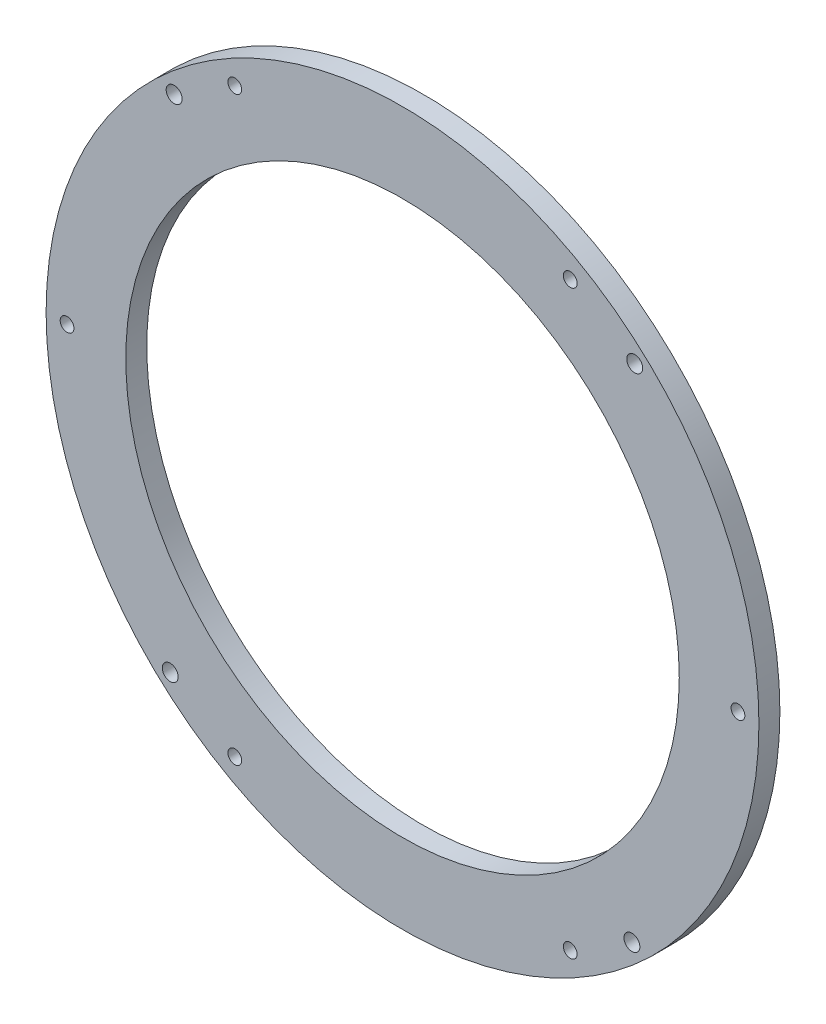
ISO-10303-21;
HEADER;
FILE_DESCRIPTION(('STEP AP214'),'2;1');
FILE_NAME('part.step','',(''),(''),'','','');
FILE_SCHEMA(('AUTOMOTIVE_DESIGN { 1 0 10303 214 1 1 1 1 }'));
ENDSEC;
DATA;
#1=APPLICATION_CONTEXT('core data for automotive mechanical design processes');
#2=APPLICATION_PROTOCOL_DEFINITION('international standard','automotive_design',2000,#1);
#3=PRODUCT_CONTEXT('',#1,'mechanical');
#4=PRODUCT('Part','Part','',(#3));
#5=PRODUCT_RELATED_PRODUCT_CATEGORY('part','',(#4));
#6=PRODUCT_DEFINITION_FORMATION('','',#4);
#7=PRODUCT_DEFINITION_CONTEXT('part definition',#1,'design');
#8=PRODUCT_DEFINITION('design','',#6,#7);
#9=PRODUCT_DEFINITION_SHAPE('','',#8);
#10=(LENGTH_UNIT() NAMED_UNIT(*) SI_UNIT(.MILLI.,.METRE.));
#11=(NAMED_UNIT(*) PLANE_ANGLE_UNIT() SI_UNIT($,.RADIAN.));
#12=(NAMED_UNIT(*) SI_UNIT($,.STERADIAN.) SOLID_ANGLE_UNIT());
#13=UNCERTAINTY_MEASURE_WITH_UNIT(LENGTH_MEASURE(1.E-05),#10,'distance_accuracy_value','');
#14=(GEOMETRIC_REPRESENTATION_CONTEXT(3) GLOBAL_UNCERTAINTY_ASSIGNED_CONTEXT((#13)) GLOBAL_UNIT_ASSIGNED_CONTEXT((#10,
#11,#12)) REPRESENTATION_CONTEXT('',''));
#15=CARTESIAN_POINT('',(0.,0.,0.));
#16=DIRECTION('',(0.,0.,1.));
#17=DIRECTION('',(1.,0.,0.));
#18=AXIS2_PLACEMENT_3D('',#15,#16,#17);
#19=CARTESIAN_POINT('',(51.7383814674162,55.5933193944043,6.35));
#20=DIRECTION('',(0.,0.,1.));
#21=DIRECTION('',(1.,0.,0.));
#22=AXIS2_PLACEMENT_3D('',#19,#20,#21);
#23=PLANE('',#22);
#24=CARTESIAN_POINT('',(122.063410719543,131.252946957816,6.35));
#25=DIRECTION('',(0.,0.,1.));
#26=DIRECTION('',(1.,0.,0.));
#27=AXIS2_PLACEMENT_3D('',#24,#25,#26);
#28=CIRCLE('',#27,2.41300000000001);
#29=CARTESIAN_POINT('',(124.476410719543,131.252946957816,6.35));
#30=VERTEX_POINT('',#29);
#31=EDGE_CURVE('E145',#30,#30,#28,.T.);
#32=ORIENTED_EDGE('',*,*,#31,.F.);
#33=EDGE_LOOP('',(#32));
#34=FACE_BOUND('',#33,.T.);
#35=CARTESIAN_POINT('',(-17.430655728391,132.126237321712,6.35));
#36=DIRECTION('',(0.,0.,1.));
#37=DIRECTION('',(1.,0.,0.));
#38=AXIS2_PLACEMENT_3D('',#35,#36,#37);
#39=CIRCLE('',#38,2.41300000000001);
#40=CARTESIAN_POINT('',(-15.017655728391,132.126237321712,6.35));
#41=VERTEX_POINT('',#40);
#42=EDGE_CURVE('E138',#41,#41,#39,.T.);
#43=ORIENTED_EDGE('',*,*,#42,.F.);
#44=EDGE_LOOP('',(#43));
#45=FACE_BOUND('',#44,.T.);
#46=CARTESIAN_POINT('',(102.538381467416,-32.3948616300948,6.35));
#47=DIRECTION('',(0.,0.,1.));
#48=DIRECTION('',(1.,0.,0.));
#49=AXIS2_PLACEMENT_3D('',#46,#47,#48);
#50=CIRCLE('',#49,2.085);
#51=CARTESIAN_POINT('',(104.623381467416,-32.3948616300948,6.35));
#52=VERTEX_POINT('',#51);
#53=EDGE_CURVE('E71',#52,#52,#50,.T.);
#54=ORIENTED_EDGE('',*,*,#53,.F.);
#55=EDGE_LOOP('',(#54));
#56=FACE_BOUND('',#55,.T.);
#57=CARTESIAN_POINT('',(153.338381467416,55.5933193944041,6.35));
#58=DIRECTION('',(0.,0.,1.));
#59=DIRECTION('',(1.,0.,0.));
#60=AXIS2_PLACEMENT_3D('',#57,#58,#59);
#61=CIRCLE('',#60,2.08500000000002);
#62=CARTESIAN_POINT('',(155.423381467416,55.5933193944041,6.35));
#63=VERTEX_POINT('',#62);
#64=EDGE_CURVE('E78',#63,#63,#61,.T.);
#65=ORIENTED_EDGE('',*,*,#64,.F.);
#66=EDGE_LOOP('',(#65));
#67=FACE_BOUND('',#66,.T.);
#68=CARTESIAN_POINT('',(102.538381467416,143.581500418903,6.35));
#69=DIRECTION('',(0.,0.,1.));
#70=DIRECTION('',(1.,0.,0.));
#71=AXIS2_PLACEMENT_3D('',#68,#69,#70);
#72=CIRCLE('',#71,2.085);
#73=CARTESIAN_POINT('',(104.623381467416,143.581500418903,6.35));
#74=VERTEX_POINT('',#73);
#75=EDGE_CURVE('E82',#74,#74,#72,.T.);
#76=ORIENTED_EDGE('',*,*,#75,.F.);
#77=EDGE_LOOP('',(#76));
#78=FACE_BOUND('',#77,.T.);
#79=CARTESIAN_POINT('',(0.938381467416333,143.581500418903,6.35));
#80=DIRECTION('',(0.,0.,1.));
#81=DIRECTION('',(1.,0.,0.));
#82=AXIS2_PLACEMENT_3D('',#79,#80,#81);
#83=CIRCLE('',#82,2.08500000000001);
#84=CARTESIAN_POINT('',(3.02338146741635,143.581500418903,6.35));
#85=VERTEX_POINT('',#84);
#86=EDGE_CURVE('E86',#85,#85,#83,.T.);
#87=ORIENTED_EDGE('',*,*,#86,.F.);
#88=EDGE_LOOP('',(#87));
#89=FACE_BOUND('',#88,.T.);
#90=CARTESIAN_POINT('',(-18.6153813848059,-20.0661282846542,6.35));
#91=DIRECTION('',(0.,0.,1.));
#92=DIRECTION('',(1.,0.,0.));
#93=AXIS2_PLACEMENT_3D('',#90,#91,#92);
#94=CIRCLE('',#93,2.413);
#95=CARTESIAN_POINT('',(-16.2023813848059,-20.0661282846542,6.35));
#96=VERTEX_POINT('',#95);
#97=EDGE_CURVE('E90',#96,#96,#94,.T.);
#98=ORIENTED_EDGE('',*,*,#97,.F.);
#99=EDGE_LOOP('',(#98));
#100=FACE_BOUND('',#99,.T.);
#101=CARTESIAN_POINT('',(121.212212688711,-20.941506668987,6.35));
#102=DIRECTION('',(0.,0.,1.));
#103=DIRECTION('',(1.,0.,0.));
#104=AXIS2_PLACEMENT_3D('',#101,#102,#103);
#105=CIRCLE('',#104,2.41300000000001);
#106=CARTESIAN_POINT('',(123.625212688711,-20.941506668987,6.35));
#107=VERTEX_POINT('',#106);
#108=EDGE_CURVE('E94',#107,#107,#105,.T.);
#109=ORIENTED_EDGE('',*,*,#108,.F.);
#110=EDGE_LOOP('',(#109));
#111=FACE_BOUND('',#110,.T.);
#112=CARTESIAN_POINT('',(-49.8616185325838,55.5933193944045,6.35));
#113=DIRECTION('',(0.,0.,1.));
#114=DIRECTION('',(1.,0.,0.));
#115=AXIS2_PLACEMENT_3D('',#112,#113,#114);
#116=CIRCLE('',#115,2.085);
#117=CARTESIAN_POINT('',(-47.7766185325838,55.5933193944045,6.35));
#118=VERTEX_POINT('',#117);
#119=EDGE_CURVE('E98',#118,#118,#116,.T.);
#120=ORIENTED_EDGE('',*,*,#119,.F.);
#121=EDGE_LOOP('',(#120));
#122=FACE_BOUND('',#121,.T.);
#123=CARTESIAN_POINT('',(0.938381467416061,-32.3948616300946,6.35));
#124=DIRECTION('',(0.,0.,1.));
#125=DIRECTION('',(1.,0.,0.));
#126=AXIS2_PLACEMENT_3D('',#123,#124,#125);
#127=CIRCLE('',#126,2.08500000000002);
#128=CARTESIAN_POINT('',(3.02338146741608,-32.3948616300946,6.35));
#129=VERTEX_POINT('',#128);
#130=EDGE_CURVE('E102',#129,#129,#127,.T.);
#131=ORIENTED_EDGE('',*,*,#130,.F.);
#132=EDGE_LOOP('',(#131));
#133=FACE_BOUND('',#132,.T.);
#134=CARTESIAN_POINT('',(51.7383814674162,55.5933193944043,6.35));
#135=DIRECTION('',(0.,0.,1.));
#136=DIRECTION('',(1.,0.,0.));
#137=AXIS2_PLACEMENT_3D('',#134,#135,#136);
#138=CIRCLE('',#137,107.95);
#139=CARTESIAN_POINT('',(159.688381467416,55.5933193944043,6.35));
#140=VERTEX_POINT('',#139);
#141=EDGE_CURVE('E12',#140,#140,#138,.T.);
#142=ORIENTED_EDGE('',*,*,#141,.T.);
#143=EDGE_LOOP('',(#142));
#144=FACE_BOUND('',#143,.T.);
#145=CARTESIAN_POINT('',(51.7383814674162,55.5933193944043,6.35));
#146=DIRECTION('',(0.,0.,1.));
#147=DIRECTION('',(1.,0.,0.));
#148=AXIS2_PLACEMENT_3D('',#145,#146,#147);
#149=CIRCLE('',#148,83.82);
#150=CARTESIAN_POINT('',(135.558381467416,55.5933193944043,6.35));
#151=VERTEX_POINT('',#150);
#152=EDGE_CURVE('E65',#151,#151,#149,.T.);
#153=ORIENTED_EDGE('',*,*,#152,.F.);
#154=EDGE_LOOP('',(#153));
#155=FACE_BOUND('',#154,.T.);
#156=ADVANCED_FACE('F50',(#34,#45,#56,#67,#78,#89,#100,#111,#122,#133,#144,#155),#23,.T.);
#157=CARTESIAN_POINT('',(51.7383814674162,55.5933193944043,0.));
#158=DIRECTION('',(0.,0.,1.));
#159=DIRECTION('',(1.,0.,0.));
#160=AXIS2_PLACEMENT_3D('',#157,#158,#159);
#161=PLANE('',#160);
#162=CARTESIAN_POINT('',(122.063410719543,131.252946957816,0.));
#163=DIRECTION('',(0.,0.,1.));
#164=DIRECTION('',(1.,0.,0.));
#165=AXIS2_PLACEMENT_3D('',#162,#163,#164);
#166=CIRCLE('',#165,2.41300000000001);
#167=CARTESIAN_POINT('',(124.476410719543,131.252946957816,0.));
#168=VERTEX_POINT('',#167);
#169=EDGE_CURVE('E137',#168,#168,#166,.T.);
#170=ORIENTED_EDGE('',*,*,#169,.T.);
#171=EDGE_LOOP('',(#170));
#172=FACE_BOUND('',#171,.T.);
#173=CARTESIAN_POINT('',(-17.430655728391,132.126237321712,0.));
#174=DIRECTION('',(0.,0.,1.));
#175=DIRECTION('',(1.,0.,0.));
#176=AXIS2_PLACEMENT_3D('',#173,#174,#175);
#177=CIRCLE('',#176,2.41300000000001);
#178=CARTESIAN_POINT('',(-15.017655728391,132.126237321712,0.));
#179=VERTEX_POINT('',#178);
#180=EDGE_CURVE('E141',#179,#179,#177,.T.);
#181=ORIENTED_EDGE('',*,*,#180,.T.);
#182=EDGE_LOOP('',(#181));
#183=FACE_BOUND('',#182,.T.);
#184=CARTESIAN_POINT('',(102.538381467416,-32.3948616300948,0.));
#185=DIRECTION('',(0.,0.,-1.));
#186=DIRECTION('',(-1.,0.,0.));
#187=AXIS2_PLACEMENT_3D('',#184,#185,#186);
#188=CIRCLE('',#187,2.085);
#189=CARTESIAN_POINT('',(100.453381467416,-32.3948616300948,0.));
#190=VERTEX_POINT('',#189);
#191=EDGE_CURVE('E110',#190,#190,#188,.T.);
#192=ORIENTED_EDGE('',*,*,#191,.F.);
#193=EDGE_LOOP('',(#192));
#194=FACE_BOUND('',#193,.T.);
#195=CARTESIAN_POINT('',(153.338381467416,55.5933193944041,0.));
#196=DIRECTION('',(0.,0.,-1.));
#197=DIRECTION('',(-1.,0.,0.));
#198=AXIS2_PLACEMENT_3D('',#195,#196,#197);
#199=CIRCLE('',#198,2.08500000000002);
#200=CARTESIAN_POINT('',(151.253381467416,55.5933193944041,0.));
#201=VERTEX_POINT('',#200);
#202=EDGE_CURVE('E120',#201,#201,#199,.T.);
#203=ORIENTED_EDGE('',*,*,#202,.F.);
#204=EDGE_LOOP('',(#203));
#205=FACE_BOUND('',#204,.T.);
#206=CARTESIAN_POINT('',(102.538381467416,143.581500418903,0.));
#207=DIRECTION('',(0.,0.,-1.));
#208=DIRECTION('',(-1.,0.,0.));
#209=AXIS2_PLACEMENT_3D('',#206,#207,#208);
#210=CIRCLE('',#209,2.085);
#211=CARTESIAN_POINT('',(100.453381467416,143.581500418903,0.));
#212=VERTEX_POINT('',#211);
#213=EDGE_CURVE('E115',#212,#212,#210,.T.);
#214=ORIENTED_EDGE('',*,*,#213,.F.);
#215=EDGE_LOOP('',(#214));
#216=FACE_BOUND('',#215,.T.);
#217=CARTESIAN_POINT('',(0.938381467416333,143.581500418903,0.));
#218=DIRECTION('',(0.,0.,-1.));
#219=DIRECTION('',(-1.,0.,0.));
#220=AXIS2_PLACEMENT_3D('',#217,#218,#219);
#221=CIRCLE('',#220,2.08500000000001);
#222=CARTESIAN_POINT('',(-1.14661853258368,143.581500418903,0.));
#223=VERTEX_POINT('',#222);
#224=EDGE_CURVE('E111',#223,#223,#221,.T.);
#225=ORIENTED_EDGE('',*,*,#224,.F.);
#226=EDGE_LOOP('',(#225));
#227=FACE_BOUND('',#226,.T.);
#228=CARTESIAN_POINT('',(-18.6153813848059,-20.0661282846542,0.));
#229=DIRECTION('',(0.,0.,-1.));
#230=DIRECTION('',(-1.,0.,0.));
#231=AXIS2_PLACEMENT_3D('',#228,#229,#230);
#232=CIRCLE('',#231,2.413);
#233=CARTESIAN_POINT('',(-21.0283813848059,-20.0661282846542,0.));
#234=VERTEX_POINT('',#233);
#235=EDGE_CURVE('E130',#234,#234,#232,.T.);
#236=ORIENTED_EDGE('',*,*,#235,.F.);
#237=EDGE_LOOP('',(#236));
#238=FACE_BOUND('',#237,.T.);
#239=CARTESIAN_POINT('',(121.212212688711,-20.941506668987,0.));
#240=DIRECTION('',(0.,0.,-1.));
#241=DIRECTION('',(-1.,0.,0.));
#242=AXIS2_PLACEMENT_3D('',#239,#240,#241);
#243=CIRCLE('',#242,2.41300000000001);
#244=CARTESIAN_POINT('',(118.799212688711,-20.941506668987,0.));
#245=VERTEX_POINT('',#244);
#246=EDGE_CURVE('E126',#245,#245,#243,.T.);
#247=ORIENTED_EDGE('',*,*,#246,.F.);
#248=EDGE_LOOP('',(#247));
#249=FACE_BOUND('',#248,.T.);
#250=CARTESIAN_POINT('',(-49.8616185325838,55.5933193944045,0.));
#251=DIRECTION('',(0.,0.,-1.));
#252=DIRECTION('',(-1.,0.,0.));
#253=AXIS2_PLACEMENT_3D('',#250,#251,#252);
#254=CIRCLE('',#253,2.085);
#255=CARTESIAN_POINT('',(-51.9466185325838,55.5933193944045,0.));
#256=VERTEX_POINT('',#255);
#257=EDGE_CURVE('E116',#256,#256,#254,.T.);
#258=ORIENTED_EDGE('',*,*,#257,.F.);
#259=EDGE_LOOP('',(#258));
#260=FACE_BOUND('',#259,.T.);
#261=CARTESIAN_POINT('',(0.938381467416061,-32.3948616300946,0.));
#262=DIRECTION('',(0.,0.,-1.));
#263=DIRECTION('',(-1.,0.,0.));
#264=AXIS2_PLACEMENT_3D('',#261,#262,#263);
#265=CIRCLE('',#264,2.08500000000002);
#266=CARTESIAN_POINT('',(-1.14661853258396,-32.3948616300946,0.));
#267=VERTEX_POINT('',#266);
#268=EDGE_CURVE('E106',#267,#267,#265,.T.);
#269=ORIENTED_EDGE('',*,*,#268,.F.);
#270=EDGE_LOOP('',(#269));
#271=FACE_BOUND('',#270,.T.);
#272=CARTESIAN_POINT('',(51.7383814674162,55.5933193944043,0.));
#273=DIRECTION('',(0.,0.,1.));
#274=DIRECTION('',(1.,0.,0.));
#275=AXIS2_PLACEMENT_3D('',#272,#273,#274);
#276=CIRCLE('',#275,107.95);
#277=CARTESIAN_POINT('',(159.688381467416,55.5933193944043,0.));
#278=VERTEX_POINT('',#277);
#279=EDGE_CURVE('E54',#278,#278,#276,.T.);
#280=ORIENTED_EDGE('',*,*,#279,.F.);
#281=EDGE_LOOP('',(#280));
#282=FACE_BOUND('',#281,.T.);
#283=CARTESIAN_POINT('',(51.7383814674162,55.5933193944043,0.));
#284=DIRECTION('',(0.,0.,1.));
#285=DIRECTION('',(1.,0.,0.));
#286=AXIS2_PLACEMENT_3D('',#283,#284,#285);
#287=CIRCLE('',#286,83.82);
#288=CARTESIAN_POINT('',(135.558381467416,55.5933193944043,0.));
#289=VERTEX_POINT('',#288);
#290=EDGE_CURVE('E67',#289,#289,#287,.T.);
#291=ORIENTED_EDGE('',*,*,#290,.T.);
#292=EDGE_LOOP('',(#291));
#293=FACE_BOUND('',#292,.T.);
#294=ADVANCED_FACE('F153',(#172,#183,#194,#205,#216,#227,#238,#249,#260,#271,#282,#293),#161,.F.);
#295=CARTESIAN_POINT('',(51.7383814674162,55.5933193944043,6.35));
#296=DIRECTION('',(0.,0.,-1.));
#297=DIRECTION('',(-1.,0.,0.));
#298=AXIS2_PLACEMENT_3D('',#295,#296,#297);
#299=CYLINDRICAL_SURFACE('',#298,107.95);
#300=ORIENTED_EDGE('',*,*,#141,.F.);
#301=EDGE_LOOP('',(#300));
#302=FACE_BOUND('',#301,.T.);
#303=ORIENTED_EDGE('',*,*,#279,.T.);
#304=EDGE_LOOP('',(#303));
#305=FACE_BOUND('',#304,.T.);
#306=ADVANCED_FACE('F52',(#302,#305),#299,.T.);
#307=CARTESIAN_POINT('',(51.7383814674162,55.5933193944043,6.35));
#308=DIRECTION('',(0.,0.,-1.));
#309=DIRECTION('',(-1.,0.,0.));
#310=AXIS2_PLACEMENT_3D('',#307,#308,#309);
#311=CYLINDRICAL_SURFACE('',#310,83.82);
#312=ORIENTED_EDGE('',*,*,#152,.T.);
#313=EDGE_LOOP('',(#312));
#314=FACE_BOUND('',#313,.T.);
#315=ORIENTED_EDGE('',*,*,#290,.F.);
#316=EDGE_LOOP('',(#315));
#317=FACE_BOUND('',#316,.T.);
#318=ADVANCED_FACE('F186',(#314,#317),#311,.F.);
#319=CARTESIAN_POINT('',(0.938381467416061,-32.3948616300946,21.336));
#320=DIRECTION('',(0.,0.,-1.));
#321=DIRECTION('',(-1.,0.,0.));
#322=AXIS2_PLACEMENT_3D('',#319,#320,#321);
#323=CYLINDRICAL_SURFACE('',#322,2.08500000000002);
#324=ORIENTED_EDGE('',*,*,#130,.T.);
#325=EDGE_LOOP('',(#324));
#326=FACE_BOUND('',#325,.T.);
#327=ORIENTED_EDGE('',*,*,#268,.T.);
#328=EDGE_LOOP('',(#327));
#329=FACE_BOUND('',#328,.T.);
#330=ADVANCED_FACE('F189',(#326,#329),#323,.F.);
#331=CARTESIAN_POINT('',(-49.8616185325838,55.5933193944045,21.336));
#332=DIRECTION('',(0.,0.,-1.));
#333=DIRECTION('',(-1.,0.,0.));
#334=AXIS2_PLACEMENT_3D('',#331,#332,#333);
#335=CYLINDRICAL_SURFACE('',#334,2.085);
#336=ORIENTED_EDGE('',*,*,#119,.T.);
#337=EDGE_LOOP('',(#336));
#338=FACE_BOUND('',#337,.T.);
#339=ORIENTED_EDGE('',*,*,#257,.T.);
#340=EDGE_LOOP('',(#339));
#341=FACE_BOUND('',#340,.T.);
#342=ADVANCED_FACE('F201',(#338,#341),#335,.F.);
#343=CARTESIAN_POINT('',(121.212212688711,-20.941506668987,21.336));
#344=DIRECTION('',(0.,0.,-1.));
#345=DIRECTION('',(-1.,0.,0.));
#346=AXIS2_PLACEMENT_3D('',#343,#344,#345);
#347=CYLINDRICAL_SURFACE('',#346,2.41300000000001);
#348=ORIENTED_EDGE('',*,*,#108,.T.);
#349=EDGE_LOOP('',(#348));
#350=FACE_BOUND('',#349,.T.);
#351=ORIENTED_EDGE('',*,*,#246,.T.);
#352=EDGE_LOOP('',(#351));
#353=FACE_BOUND('',#352,.T.);
#354=ADVANCED_FACE('F220',(#350,#353),#347,.F.);
#355=CARTESIAN_POINT('',(-18.6153813848059,-20.0661282846542,21.336));
#356=DIRECTION('',(0.,0.,-1.));
#357=DIRECTION('',(-1.,0.,0.));
#358=AXIS2_PLACEMENT_3D('',#355,#356,#357);
#359=CYLINDRICAL_SURFACE('',#358,2.413);
#360=ORIENTED_EDGE('',*,*,#97,.T.);
#361=EDGE_LOOP('',(#360));
#362=FACE_BOUND('',#361,.T.);
#363=ORIENTED_EDGE('',*,*,#235,.T.);
#364=EDGE_LOOP('',(#363));
#365=FACE_BOUND('',#364,.T.);
#366=ADVANCED_FACE('F207',(#362,#365),#359,.F.);
#367=CARTESIAN_POINT('',(0.938381467416333,143.581500418903,21.336));
#368=DIRECTION('',(0.,0.,-1.));
#369=DIRECTION('',(-1.,0.,0.));
#370=AXIS2_PLACEMENT_3D('',#367,#368,#369);
#371=CYLINDRICAL_SURFACE('',#370,2.08500000000001);
#372=ORIENTED_EDGE('',*,*,#86,.T.);
#373=EDGE_LOOP('',(#372));
#374=FACE_BOUND('',#373,.T.);
#375=ORIENTED_EDGE('',*,*,#224,.T.);
#376=EDGE_LOOP('',(#375));
#377=FACE_BOUND('',#376,.T.);
#378=ADVANCED_FACE('F203',(#374,#377),#371,.F.);
#379=CARTESIAN_POINT('',(102.538381467416,143.581500418903,21.336));
#380=DIRECTION('',(0.,0.,-1.));
#381=DIRECTION('',(-1.,0.,0.));
#382=AXIS2_PLACEMENT_3D('',#379,#380,#381);
#383=CYLINDRICAL_SURFACE('',#382,2.085);
#384=ORIENTED_EDGE('',*,*,#75,.T.);
#385=EDGE_LOOP('',(#384));
#386=FACE_BOUND('',#385,.T.);
#387=ORIENTED_EDGE('',*,*,#213,.T.);
#388=EDGE_LOOP('',(#387));
#389=FACE_BOUND('',#388,.T.);
#390=ADVANCED_FACE('F206',(#386,#389),#383,.F.);
#391=CARTESIAN_POINT('',(153.338381467416,55.5933193944041,21.336));
#392=DIRECTION('',(0.,0.,-1.));
#393=DIRECTION('',(-1.,0.,0.));
#394=AXIS2_PLACEMENT_3D('',#391,#392,#393);
#395=CYLINDRICAL_SURFACE('',#394,2.08500000000002);
#396=ORIENTED_EDGE('',*,*,#64,.T.);
#397=EDGE_LOOP('',(#396));
#398=FACE_BOUND('',#397,.T.);
#399=ORIENTED_EDGE('',*,*,#202,.T.);
#400=EDGE_LOOP('',(#399));
#401=FACE_BOUND('',#400,.T.);
#402=ADVANCED_FACE('F211',(#398,#401),#395,.F.);
#403=CARTESIAN_POINT('',(102.538381467416,-32.3948616300948,21.336));
#404=DIRECTION('',(0.,0.,-1.));
#405=DIRECTION('',(-1.,0.,0.));
#406=AXIS2_PLACEMENT_3D('',#403,#404,#405);
#407=CYLINDRICAL_SURFACE('',#406,2.085);
#408=ORIENTED_EDGE('',*,*,#53,.T.);
#409=EDGE_LOOP('',(#408));
#410=FACE_BOUND('',#409,.T.);
#411=ORIENTED_EDGE('',*,*,#191,.T.);
#412=EDGE_LOOP('',(#411));
#413=FACE_BOUND('',#412,.T.);
#414=ADVANCED_FACE('F215',(#410,#413),#407,.F.);
#415=CARTESIAN_POINT('',(-17.430655728391,132.126237321712,0.));
#416=DIRECTION('',(0.,0.,1.));
#417=DIRECTION('',(1.,0.,0.));
#418=AXIS2_PLACEMENT_3D('',#415,#416,#417);
#419=CYLINDRICAL_SURFACE('',#418,2.41300000000001);
#420=ORIENTED_EDGE('',*,*,#180,.F.);
#421=EDGE_LOOP('',(#420));
#422=FACE_BOUND('',#421,.T.);
#423=ORIENTED_EDGE('',*,*,#42,.T.);
#424=EDGE_LOOP('',(#423));
#425=FACE_BOUND('',#424,.T.);
#426=ADVANCED_FACE('F159',(#422,#425),#419,.F.);
#427=CARTESIAN_POINT('',(122.063410719543,131.252946957816,0.));
#428=DIRECTION('',(0.,0.,1.));
#429=DIRECTION('',(1.,0.,0.));
#430=AXIS2_PLACEMENT_3D('',#427,#428,#429);
#431=CYLINDRICAL_SURFACE('',#430,2.41300000000001);
#432=ORIENTED_EDGE('',*,*,#169,.F.);
#433=EDGE_LOOP('',(#432));
#434=FACE_BOUND('',#433,.T.);
#435=ORIENTED_EDGE('',*,*,#31,.T.);
#436=EDGE_LOOP('',(#435));
#437=FACE_BOUND('',#436,.T.);
#438=ADVANCED_FACE('F156',(#434,#437),#431,.F.);
#439=CLOSED_SHELL('',(#156,#294,#306,#318,#330,#342,#354,#366,#378,#390,#402,#414,#426,#438));
#440=MANIFOLD_SOLID_BREP('B2',#439);
#441=ADVANCED_BREP_SHAPE_REPRESENTATION('',(#18,#440),#14);
#442=SHAPE_DEFINITION_REPRESENTATION(#9,#441);
ENDSEC;
END-ISO-10303-21;
